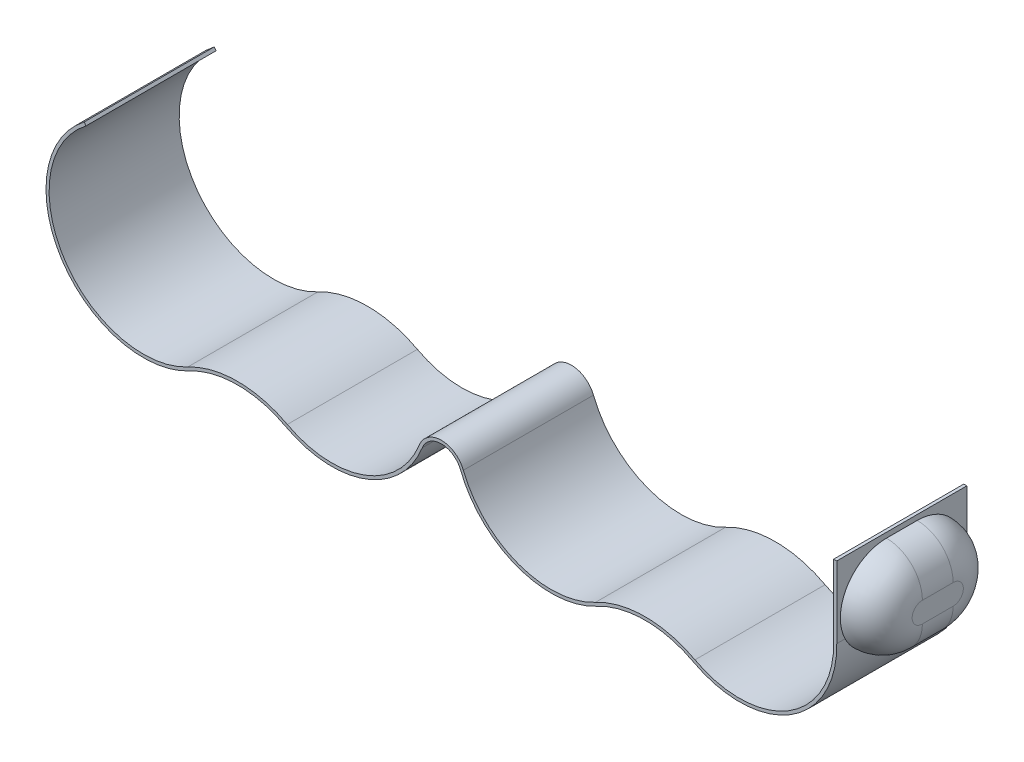
ISO-10303-21;
HEADER;
FILE_DESCRIPTION(('STEP AP214'),'2;1');
FILE_NAME('part.step','',(''),(''),'','','');
FILE_SCHEMA(('AUTOMOTIVE_DESIGN { 1 0 10303 214 1 1 1 1 }'));
ENDSEC;
DATA;
#1=APPLICATION_CONTEXT('core data for automotive mechanical design processes');
#2=APPLICATION_PROTOCOL_DEFINITION('international standard','automotive_design',2000,#1);
#3=PRODUCT_CONTEXT('',#1,'mechanical');
#4=PRODUCT('Part','Part','',(#3));
#5=PRODUCT_RELATED_PRODUCT_CATEGORY('part','',(#4));
#6=PRODUCT_DEFINITION_FORMATION('','',#4);
#7=PRODUCT_DEFINITION_CONTEXT('part definition',#1,'design');
#8=PRODUCT_DEFINITION('design','',#6,#7);
#9=PRODUCT_DEFINITION_SHAPE('','',#8);
#10=(LENGTH_UNIT() NAMED_UNIT(*) SI_UNIT(.MILLI.,.METRE.));
#11=(NAMED_UNIT(*) PLANE_ANGLE_UNIT() SI_UNIT($,.RADIAN.));
#12=(NAMED_UNIT(*) SI_UNIT($,.STERADIAN.) SOLID_ANGLE_UNIT());
#13=UNCERTAINTY_MEASURE_WITH_UNIT(LENGTH_MEASURE(1.E-05),#10,'distance_accuracy_value','');
#14=(GEOMETRIC_REPRESENTATION_CONTEXT(3) GLOBAL_UNCERTAINTY_ASSIGNED_CONTEXT((#13)) GLOBAL_UNIT_ASSIGNED_CONTEXT((#10,
#11,#12)) REPRESENTATION_CONTEXT('',''));
#15=CARTESIAN_POINT('',(0.,0.,0.));
#16=DIRECTION('',(0.,0.,1.));
#17=DIRECTION('',(1.,0.,0.));
#18=AXIS2_PLACEMENT_3D('',#15,#16,#17);
#19=CARTESIAN_POINT('',(29.1,11.5,6.35));
#20=DIRECTION('',(0.,0.,-1.));
#21=DIRECTION('',(-1.,0.,0.));
#22=AXIS2_PLACEMENT_3D('',#19,#20,#21);
#23=CYLINDRICAL_SURFACE('',#22,9.49999999999999);
#24=CARTESIAN_POINT('',(38.5983950642177,11.674617307404,5.53386000206993));
#25=CARTESIAN_POINT('',(38.5986630631285,11.6600390391527,5.52665198756606));
#26=CARTESIAN_POINT('',(38.5988966374525,11.645499346526,5.51936468503523));
#27=CARTESIAN_POINT('',(38.5992974076988,11.6164093473269,5.50458689957417));
#28=CARTESIAN_POINT('',(38.5994641838743,11.6018595319501,5.49709543831724));
#29=CARTESIAN_POINT('',(38.5997313609646,11.5727525289645,5.48190727155781));
#30=CARTESIAN_POINT('',(38.5998313461403,11.5581958493997,5.47420958512914));
#31=CARTESIAN_POINT('',(38.5999649353353,11.5290784160446,5.45860694465073));
#32=CARTESIAN_POINT('',(38.5999981275434,11.5145181872133,5.45070100740795));
#33=CARTESIAN_POINT('',(38.5999981275301,11.4853970198671,5.43467987599623));
#34=CARTESIAN_POINT('',(38.5999645274169,11.4708366233534,5.4265636966541));
#35=CARTESIAN_POINT('',(38.5998309382488,11.4417185484636,5.4101201301041));
#36=CARTESIAN_POINT('',(38.5997305451884,11.4271614292349,5.4017917560499));
#37=CARTESIAN_POINT('',(38.5994633680931,11.39805340353,5.38492188651101));
#38=CARTESIAN_POINT('',(38.5992961839278,11.3835030734703,5.37637940280155));
#39=CARTESIAN_POINT('',(38.5988954139974,11.3544121772569,5.35907944735473));
#40=CARTESIAN_POINT('',(38.5986614318976,11.3398722048464,5.35032098636093));
#41=CARTESIAN_POINT('',(38.5983950642177,11.3253826925965,5.34148080320608));
#42=B_SPLINE_CURVE_WITH_KNOTS('',3,(#24,#25,#26,#27,#28,#29,#30,#31,#32,#33,#34,#35,#36,#37,#38,
#39,#40,#41),.UNSPECIFIED.,.F.,.F.,(4,2,2,2,2,2,2,2,4),(0.,0.0487949925973613,
0.0978919661736322,0.147291764006221,0.196995213957855,0.247003128809342,0.297316306584729,
0.347935530869065,0.398861571118844),.UNSPECIFIED.);
#43=CARTESIAN_POINT('',(38.5983950642177,11.674617307404,5.53386000206993));
#44=VERTEX_POINT('',#43);
#45=CARTESIAN_POINT('',(38.5983950642177,11.3253826925965,5.34148080320608));
#46=VERTEX_POINT('',#45);
#47=EDGE_CURVE('E507',#44,#46,#42,.T.);
#48=ORIENTED_EDGE('',*,*,#47,.F.);
#49=DIRECTION('',(0.,0.,-1.));
#50=VECTOR('',#49,1.);
#51=CARTESIAN_POINT('',(38.5983950642177,11.674617307404,6.35));
#52=LINE('',#51,#50);
#53=CARTESIAN_POINT('',(38.5983950642177,11.674617307404,6.35));
#54=VERTEX_POINT('',#53);
#55=EDGE_CURVE('E226',#54,#44,#52,.T.);
#56=ORIENTED_EDGE('',*,*,#55,.F.);
#57=CARTESIAN_POINT('',(29.1,11.5,6.35));
#58=DIRECTION('',(0.,0.,1.));
#59=DIRECTION('',(1.,0.,0.));
#60=AXIS2_PLACEMENT_3D('',#57,#58,#59);
#61=CIRCLE('',#60,9.49999999999999);
#62=CARTESIAN_POINT('',(24.6179487179487,3.1237707585655,6.35));
#63=VERTEX_POINT('',#62);
#64=EDGE_CURVE('E477',#63,#54,#61,.T.);
#65=ORIENTED_EDGE('',*,*,#64,.F.);
#66=DIRECTION('',(0.,0.,-1.));
#67=VECTOR('',#66,1.);
#68=CARTESIAN_POINT('',(24.6179487179487,3.1237707585655,6.35));
#69=LINE('',#68,#67);
#70=CARTESIAN_POINT('',(24.6179487179487,3.1237707585655,-6.35));
#71=VERTEX_POINT('',#70);
#72=EDGE_CURVE('E355',#63,#71,#69,.T.);
#73=ORIENTED_EDGE('',*,*,#72,.T.);
#74=CARTESIAN_POINT('',(29.1,11.5,-6.35));
#75=DIRECTION('',(0.,0.,1.));
#76=DIRECTION('',(1.,0.,0.));
#77=AXIS2_PLACEMENT_3D('',#74,#75,#76);
#78=CIRCLE('',#77,9.49999999999999);
#79=CARTESIAN_POINT('',(38.5983950642177,11.674617307404,-6.35));
#80=VERTEX_POINT('',#79);
#81=EDGE_CURVE('E395',#71,#80,#78,.T.);
#82=ORIENTED_EDGE('',*,*,#81,.T.);
#83=CARTESIAN_POINT('',(38.5983950642177,11.674617307404,-5.53386000206993));
#84=VERTEX_POINT('',#83);
#85=EDGE_CURVE('E348',#84,#80,#52,.T.);
#86=ORIENTED_EDGE('',*,*,#85,.F.);
#87=CARTESIAN_POINT('',(38.5983950642177,11.3253826925965,-5.34148080320608));
#88=CARTESIAN_POINT('',(38.5986614318976,11.3398722048464,-5.35032098636093));
#89=CARTESIAN_POINT('',(38.5988954139974,11.3544121772569,-5.35907944735473));
#90=CARTESIAN_POINT('',(38.5992961839278,11.3835030734703,-5.37637940280156));
#91=CARTESIAN_POINT('',(38.5994633680931,11.39805340353,-5.38492188651101));
#92=CARTESIAN_POINT('',(38.5997305451884,11.4271614292349,-5.4017917560499));
#93=CARTESIAN_POINT('',(38.5998309382488,11.4417185484636,-5.4101201301041));
#94=CARTESIAN_POINT('',(38.5999645274169,11.4708366233534,-5.4265636966541));
#95=CARTESIAN_POINT('',(38.5999981275301,11.4853970198671,-5.43467987599623));
#96=CARTESIAN_POINT('',(38.5999981275434,11.5145181872133,-5.45070100740795));
#97=CARTESIAN_POINT('',(38.5999649353353,11.5290784160446,-5.45860694465073));
#98=CARTESIAN_POINT('',(38.5998313461403,11.5581958493997,-5.47420958512914));
#99=CARTESIAN_POINT('',(38.5997313609646,11.5727525289645,-5.48190727155781));
#100=CARTESIAN_POINT('',(38.5994641838743,11.6018595319501,-5.49709543831724));
#101=CARTESIAN_POINT('',(38.5992974076988,11.6164093473269,-5.50458689957417));
#102=CARTESIAN_POINT('',(38.5988966374525,11.645499346526,-5.51936468503523));
#103=CARTESIAN_POINT('',(38.5986630631285,11.6600390391527,-5.52665198756606));
#104=CARTESIAN_POINT('',(38.5983950642177,11.674617307404,-5.53386000206993));
#105=B_SPLINE_CURVE_WITH_KNOTS('',3,(#87,#88,#89,#90,#91,#92,#93,#94,#95,#96,#97,#98,#99,#100,
#101,#102,#103,#104),.UNSPECIFIED.,.F.,.F.,(4,2,2,2,2,2,2,2,4),(0.,0.0509260402497801,
0.101545264534112,0.151858442309499,0.201866357160987,0.251569807112623,0.300969604945211,
0.35006657852148,0.398861571118842),.UNSPECIFIED.);
#106=CARTESIAN_POINT('',(38.5983950642177,11.3253826925965,-5.34148080320608));
#107=VERTEX_POINT('',#106);
#108=EDGE_CURVE('E240',#107,#84,#105,.T.);
#109=ORIENTED_EDGE('',*,*,#108,.F.);
#110=CARTESIAN_POINT('',(38.3096101726777,9.16910307664385,-1.5));
#111=CARTESIAN_POINT('',(38.3095868955282,9.16908842534849,-1.62512755664431));
#112=CARTESIAN_POINT('',(38.310930513268,9.17432172401688,-1.75024552474231));
#113=CARTESIAN_POINT('',(38.3161798622304,9.19517039493367,-1.9995334997406));
#114=CARTESIAN_POINT('',(38.3200850479459,9.21078355671407,-2.12370370278096));
#115=CARTESIAN_POINT('',(38.3302726262404,9.25222384662015,-2.36989839799261));
#116=CARTESIAN_POINT('',(38.3365487623277,9.27802410095488,-2.49192766044714));
#117=CARTESIAN_POINT('',(38.351145680719,9.33960733970354,-2.73328619049127));
#118=CARTESIAN_POINT('',(38.3594665200447,9.37539060252255,-2.85261538268123));
#119=CARTESIAN_POINT('',(38.3868919656161,9.49733144078351,-3.20531373574449));
#120=CARTESIAN_POINT('',(38.4084694589623,9.59811608011106,-3.43360571443809));
#121=CARTESIAN_POINT('',(38.4538922646843,9.83589810961581,-3.87031684900781));
#122=CARTESIAN_POINT('',(38.4777385008848,9.97291029228169,-4.07872783963604));
#123=CARTESIAN_POINT('',(38.512211319716,10.2087787539587,-4.37996105425983));
#124=CARTESIAN_POINT('',(38.5238699439507,10.2961633755042,-4.48182696067868));
#125=CARTESIAN_POINT('',(38.5455139616557,10.4797972751876,-4.67746958713357));
#126=CARTESIAN_POINT('',(38.5554993679915,10.5760464851565,-4.77124636936454));
#127=CARTESIAN_POINT('',(38.5729777341404,10.7769093258389,-4.95012093193739));
#128=CARTESIAN_POINT('',(38.5804648887445,10.8815417472175,-5.03519818357597));
#129=CARTESIAN_POINT('',(38.5921205581904,11.0981634340156,-5.19574002427003));
#130=CARTESIAN_POINT('',(38.5962879028057,11.2101552785725,-5.27120121581649));
#131=CARTESIAN_POINT('',(38.5983950642177,11.3253826925965,-5.34148080320608));
#132=B_SPLINE_CURVE_WITH_KNOTS('',3,(#110,#111,#112,#113,#114,#115,#116,#117,#118,#119,#120,
#121,#122,#123,#124,#125,#126,#127,#128,#129,#130,#131),.UNSPECIFIED.,.F.,.F.,(4,2,2,2,2,2,2,2,
2,2,4),(0.,0.375249781385472,0.750419676163439,1.12460640630209,1.49880357276409,
2.24656015914001,2.99462254345786,3.39830747917489,3.80198931079888,4.20660275284733,
4.61135875730409),.UNSPECIFIED.);
#133=CARTESIAN_POINT('',(38.3096101726777,9.16910307664385,-1.5));
#134=VERTEX_POINT('',#133);
#135=EDGE_CURVE('E227',#134,#107,#132,.T.);
#136=ORIENTED_EDGE('',*,*,#135,.F.);
#137=DIRECTION('',(0.,0.,-1.));
#138=VECTOR('',#137,1.);
#139=CARTESIAN_POINT('',(38.3096101726777,9.16910307664385,6.35));
#140=LINE('',#139,#138);
#141=CARTESIAN_POINT('',(38.3096101726777,9.16910307664385,1.5));
#142=VERTEX_POINT('',#141);
#143=EDGE_CURVE('E282',#142,#134,#140,.T.);
#144=ORIENTED_EDGE('',*,*,#143,.F.);
#145=CARTESIAN_POINT('',(38.5983950642177,11.3253826925965,5.34148080320608));
#146=CARTESIAN_POINT('',(38.5964309511884,11.2180735956539,5.27602694331638));
#147=CARTESIAN_POINT('',(38.592682059442,11.1135661926352,5.20608091977004));
#148=CARTESIAN_POINT('',(38.5822569053851,10.910887128789,5.05780446389393));
#149=CARTESIAN_POINT('',(38.5755816774317,10.8127132433384,4.97947700149644));
#150=CARTESIAN_POINT('',(38.5599579434277,10.62352870435,4.81513987880919));
#151=CARTESIAN_POINT('',(38.5510135872179,10.5325053674681,4.72914442615644));
#152=CARTESIAN_POINT('',(38.5315220130518,10.3580280395505,4.54998896622055));
#153=CARTESIAN_POINT('',(38.5209746774402,10.2745746048481,4.45682843328379));
#154=CARTESIAN_POINT('',(38.4879568307323,10.0364674683081,4.16762070450599));
#155=CARTESIAN_POINT('',(38.4640869451993,9.8938211693606,3.96163326294085));
#156=CARTESIAN_POINT('',(38.4179219829146,9.64459791969355,3.5287254925697));
#157=CARTESIAN_POINT('',(38.3956268634966,9.53801999145048,3.30180573128272));
#158=CARTESIAN_POINT('',(38.3661554142768,9.40463265143685,2.9429225506491));
#159=CARTESIAN_POINT('',(38.356784971456,9.36382884008897,2.81618598427103));
#160=CARTESIAN_POINT('',(38.340290074126,9.29356655248538,2.55942436590148));
#161=CARTESIAN_POINT('',(38.3331656834918,9.26410839888075,2.42939922050048));
#162=CARTESIAN_POINT('',(38.3215757249923,9.21676339404465,2.16672989598527));
#163=CARTESIAN_POINT('',(38.3171184590243,9.19891265816033,2.0340788533914));
#164=CARTESIAN_POINT('',(38.3111201472742,9.17507158134166,1.7676227747195));
#165=CARTESIAN_POINT('',(38.3095797215452,9.16908376217795,1.63381749934955));
#166=CARTESIAN_POINT('',(38.3096101726777,9.16910307664385,1.5));
#167=B_SPLINE_CURVE_WITH_KNOTS('',3,(#145,#146,#147,#148,#149,#150,#151,#152,#153,#154,#155,
#156,#157,#158,#159,#160,#161,#162,#163,#164,#165,#166),.UNSPECIFIED.,.F.,.F.,(4,2,2,2,2,2,2,2,
2,2,4),(0.,0.376973483290361,0.753813826996727,1.12996990181774,1.50615359904433,
2.25755281984319,3.00893167462031,3.40888577775613,3.80885125406211,4.21005530361564,
4.61134463034871),.UNSPECIFIED.);
#168=EDGE_CURVE('E279',#46,#142,#167,.T.);
#169=ORIENTED_EDGE('',*,*,#168,.F.);
#170=EDGE_LOOP('',(#48,#56,#65,#73,#82,#86,#109,#136,#144,#169));
#171=FACE_BOUND('',#170,.T.);
#172=ADVANCED_FACE('F32',(#171),#23,.T.);
#173=CARTESIAN_POINT('',(38.5983950642177,11.674617307404,6.35));
#174=DIRECTION('',(-1.,0.,0.));
#175=DIRECTION('',(0.,0.,1.));
#176=AXIS2_PLACEMENT_3D('',#173,#174,#175);
#177=PLANE('',#176);
#178=CARTESIAN_POINT('',(38.5983950642177,13.6691030766439,1.5));
#179=DIRECTION('',(1.,0.,0.));
#180=DIRECTION('',(0.,0.,-1.));
#181=AXIS2_PLACEMENT_3D('',#178,#179,#180);
#182=CIRCLE('',#181,4.5);
#183=CARTESIAN_POINT('',(38.5983950642177,18.1691030766439,1.5));
#184=VERTEX_POINT('',#183);
#185=EDGE_CURVE('E210',#184,#44,#182,.T.);
#186=ORIENTED_EDGE('',*,*,#185,.F.);
#187=DIRECTION('',(0.,0.,1.));
#188=VECTOR('',#187,1.);
#189=CARTESIAN_POINT('',(38.5983950642177,18.1691030766439,1.5));
#190=LINE('',#189,#188);
#191=CARTESIAN_POINT('',(38.5983950642177,18.1691030766439,-1.5));
#192=VERTEX_POINT('',#191);
#193=EDGE_CURVE('E217',#192,#184,#190,.T.);
#194=ORIENTED_EDGE('',*,*,#193,.F.);
#195=CARTESIAN_POINT('',(38.5983950642177,13.6691030766439,-1.5));
#196=DIRECTION('',(-1.,0.,0.));
#197=DIRECTION('',(0.,0.,1.));
#198=AXIS2_PLACEMENT_3D('',#195,#196,#197);
#199=CIRCLE('',#198,4.5);
#200=EDGE_CURVE('E337',#84,#192,#199,.F.);
#201=ORIENTED_EDGE('',*,*,#200,.F.);
#202=ORIENTED_EDGE('',*,*,#85,.T.);
#203=DIRECTION('',(0.,1.,0.));
#204=VECTOR('',#203,1.);
#205=CARTESIAN_POINT('',(38.5983950642177,11.674617307404,-6.35));
#206=LINE('',#205,#204);
#207=CARTESIAN_POINT('',(38.5983950642177,18.6691030766439,-6.35));
#208=VERTEX_POINT('',#207);
#209=EDGE_CURVE('E401',#80,#208,#206,.T.);
#210=ORIENTED_EDGE('',*,*,#209,.T.);
#211=DIRECTION('',(0.,0.,-1.));
#212=VECTOR('',#211,1.);
#213=CARTESIAN_POINT('',(38.5983950642177,18.6691030766439,6.35));
#214=LINE('',#213,#212);
#215=CARTESIAN_POINT('',(38.5983950642177,18.6691030766439,6.35));
#216=VERTEX_POINT('',#215);
#217=EDGE_CURVE('E350',#216,#208,#214,.T.);
#218=ORIENTED_EDGE('',*,*,#217,.F.);
#219=DIRECTION('',(0.,1.,0.));
#220=VECTOR('',#219,1.);
#221=CARTESIAN_POINT('',(38.5983950642177,11.674617307404,6.35));
#222=LINE('',#221,#220);
#223=EDGE_CURVE('E475',#54,#216,#222,.T.);
#224=ORIENTED_EDGE('',*,*,#223,.F.);
#225=ORIENTED_EDGE('',*,*,#55,.T.);
#226=EDGE_LOOP('',(#186,#194,#201,#202,#210,#218,#224,#225));
#227=FACE_BOUND('',#226,.T.);
#228=ADVANCED_FACE('F222',(#227),#177,.F.);
#229=CARTESIAN_POINT('',(-19.9,-5.69331265347081,6.35));
#230=DIRECTION('',(0.,0.,-1.));
#231=DIRECTION('',(-1.,0.,0.));
#232=AXIS2_PLACEMENT_3D('',#229,#230,#231);
#233=CYLINDRICAL_SURFACE('',#232,10.);
#234=CARTESIAN_POINT('',(-19.9,-5.69331265347081,-6.35));
#235=DIRECTION('',(0.,0.,-1.));
#236=DIRECTION('',(1.,0.,0.));
#237=AXIS2_PLACEMENT_3D('',#234,#235,#236);
#238=CIRCLE('',#237,10.);
#239=CARTESIAN_POINT('',(-24.6179487179487,3.1237707585655,-6.35));
#240=VERTEX_POINT('',#239);
#241=CARTESIAN_POINT('',(-15.1820512820513,3.1237707585655,-6.35));
#242=VERTEX_POINT('',#241);
#243=EDGE_CURVE('E503',#240,#242,#238,.T.);
#244=ORIENTED_EDGE('',*,*,#243,.T.);
#245=DIRECTION('',(0.,0.,-1.));
#246=VECTOR('',#245,1.);
#247=CARTESIAN_POINT('',(-15.1820512820513,3.1237707585655,6.35));
#248=LINE('',#247,#246);
#249=CARTESIAN_POINT('',(-15.1820512820513,3.1237707585655,6.35));
#250=VERTEX_POINT('',#249);
#251=EDGE_CURVE('E345',#250,#242,#248,.T.);
#252=ORIENTED_EDGE('',*,*,#251,.F.);
#253=CARTESIAN_POINT('',(-19.9,-5.69331265347081,6.35));
#254=DIRECTION('',(0.,0.,-1.));
#255=DIRECTION('',(1.,0.,0.));
#256=AXIS2_PLACEMENT_3D('',#253,#254,#255);
#257=CIRCLE('',#256,10.);
#258=CARTESIAN_POINT('',(-24.6179487179487,3.1237707585655,6.35));
#259=VERTEX_POINT('',#258);
#260=EDGE_CURVE('E291',#259,#250,#257,.T.);
#261=ORIENTED_EDGE('',*,*,#260,.F.);
#262=DIRECTION('',(0.,0.,-1.));
#263=VECTOR('',#262,1.);
#264=CARTESIAN_POINT('',(-24.6179487179487,3.1237707585655,6.35));
#265=LINE('',#264,#263);
#266=EDGE_CURVE('E436',#259,#240,#265,.T.);
#267=ORIENTED_EDGE('',*,*,#266,.T.);
#268=EDGE_LOOP('',(#244,#252,#261,#267));
#269=FACE_BOUND('',#268,.T.);
#270=ADVANCED_FACE('F318',(#269),#233,.F.);
#271=CARTESIAN_POINT('',(-10.7,11.5,6.35));
#272=DIRECTION('',(0.,0.,-1.));
#273=DIRECTION('',(-1.,0.,0.));
#274=AXIS2_PLACEMENT_3D('',#271,#272,#273);
#275=CYLINDRICAL_SURFACE('',#274,9.5);
#276=CARTESIAN_POINT('',(-10.7,11.5,-6.35));
#277=DIRECTION('',(0.,0.,1.));
#278=DIRECTION('',(1.,0.,0.));
#279=AXIS2_PLACEMENT_3D('',#276,#277,#278);
#280=CIRCLE('',#279,9.5);
#281=CARTESIAN_POINT('',(-1.86823913367211,8.,-6.35));
#282=VERTEX_POINT('',#281);
#283=EDGE_CURVE('E506',#242,#282,#280,.T.);
#284=ORIENTED_EDGE('',*,*,#283,.T.);
#285=DIRECTION('',(0.,0.,-1.));
#286=VECTOR('',#285,1.);
#287=CARTESIAN_POINT('',(-1.86823913367211,8.,6.35));
#288=LINE('',#287,#286);
#289=CARTESIAN_POINT('',(-1.86823913367211,8.,6.35));
#290=VERTEX_POINT('',#289);
#291=EDGE_CURVE('E528',#290,#282,#288,.T.);
#292=ORIENTED_EDGE('',*,*,#291,.F.);
#293=CARTESIAN_POINT('',(-10.7,11.5,6.35));
#294=DIRECTION('',(0.,0.,1.));
#295=DIRECTION('',(1.,0.,0.));
#296=AXIS2_PLACEMENT_3D('',#293,#294,#295);
#297=CIRCLE('',#296,9.5);
#298=EDGE_CURVE('E537',#250,#290,#297,.T.);
#299=ORIENTED_EDGE('',*,*,#298,.F.);
#300=ORIENTED_EDGE('',*,*,#251,.T.);
#301=EDGE_LOOP('',(#284,#292,#299,#300));
#302=FACE_BOUND('',#301,.T.);
#303=ADVANCED_FACE('F535',(#302),#275,.T.);
#304=CARTESIAN_POINT('',(0.,7.2596225071285,6.35));
#305=DIRECTION('',(0.,0.,-1.));
#306=DIRECTION('',(-1.,0.,0.));
#307=AXIS2_PLACEMENT_3D('',#304,#305,#306);
#308=CYLINDRICAL_SURFACE('',#307,2.00959605207981);
#309=CARTESIAN_POINT('',(0.,7.2596225071285,-6.35));
#310=DIRECTION('',(0.,0.,-1.));
#311=DIRECTION('',(-1.,0.,0.));
#312=AXIS2_PLACEMENT_3D('',#309,#310,#311);
#313=CIRCLE('',#312,2.00959605207981);
#314=CARTESIAN_POINT('',(1.86823913367219,8.,-6.35));
#315=VERTEX_POINT('',#314);
#316=EDGE_CURVE('E509',#282,#315,#313,.T.);
#317=ORIENTED_EDGE('',*,*,#316,.T.);
#318=DIRECTION('',(0.,0.,-1.));
#319=VECTOR('',#318,1.);
#320=CARTESIAN_POINT('',(1.86823913367219,8.,6.35));
#321=LINE('',#320,#319);
#322=CARTESIAN_POINT('',(1.86823913367219,8.,6.35));
#323=VERTEX_POINT('',#322);
#324=EDGE_CURVE('E524',#323,#315,#321,.T.);
#325=ORIENTED_EDGE('',*,*,#324,.F.);
#326=CARTESIAN_POINT('',(0.,7.2596225071285,6.35));
#327=DIRECTION('',(0.,0.,-1.));
#328=DIRECTION('',(-1.,0.,0.));
#329=AXIS2_PLACEMENT_3D('',#326,#327,#328);
#330=CIRCLE('',#329,2.00959605207981);
#331=EDGE_CURVE('E799',#290,#323,#330,.T.);
#332=ORIENTED_EDGE('',*,*,#331,.F.);
#333=ORIENTED_EDGE('',*,*,#291,.T.);
#334=EDGE_LOOP('',(#317,#325,#332,#333));
#335=FACE_BOUND('',#334,.T.);
#336=ADVANCED_FACE('F677',(#335),#308,.F.);
#337=CARTESIAN_POINT('',(10.7,11.5,6.35));
#338=DIRECTION('',(0.,0.,-1.));
#339=DIRECTION('',(-1.,0.,0.));
#340=AXIS2_PLACEMENT_3D('',#337,#338,#339);
#341=CYLINDRICAL_SURFACE('',#340,9.49999999999999);
#342=CARTESIAN_POINT('',(10.7,11.5,-6.35));
#343=DIRECTION('',(0.,0.,1.));
#344=DIRECTION('',(1.,0.,0.));
#345=AXIS2_PLACEMENT_3D('',#342,#343,#344);
#346=CIRCLE('',#345,9.49999999999999);
#347=CARTESIAN_POINT('',(15.1820512820513,3.12377075856549,-6.35));
#348=VERTEX_POINT('',#347);
#349=EDGE_CURVE('E511',#315,#348,#346,.T.);
#350=ORIENTED_EDGE('',*,*,#349,.T.);
#351=DIRECTION('',(0.,0.,-1.));
#352=VECTOR('',#351,1.);
#353=CARTESIAN_POINT('',(15.1820512820513,3.12377075856549,6.35));
#354=LINE('',#353,#352);
#355=CARTESIAN_POINT('',(15.1820512820513,3.12377075856549,6.35));
#356=VERTEX_POINT('',#355);
#357=EDGE_CURVE('E516',#356,#348,#354,.T.);
#358=ORIENTED_EDGE('',*,*,#357,.F.);
#359=CARTESIAN_POINT('',(10.7,11.5,6.35));
#360=DIRECTION('',(0.,0.,1.));
#361=DIRECTION('',(1.,0.,0.));
#362=AXIS2_PLACEMENT_3D('',#359,#360,#361);
#363=CIRCLE('',#362,9.49999999999999);
#364=EDGE_CURVE('E525',#323,#356,#363,.T.);
#365=ORIENTED_EDGE('',*,*,#364,.F.);
#366=ORIENTED_EDGE('',*,*,#324,.T.);
#367=EDGE_LOOP('',(#350,#358,#365,#366));
#368=FACE_BOUND('',#367,.T.);
#369=ADVANCED_FACE('F521',(#368),#341,.T.);
#370=CARTESIAN_POINT('',(19.9,-5.69331265347081,6.35));
#371=DIRECTION('',(0.,0.,-1.));
#372=DIRECTION('',(-1.,0.,0.));
#373=AXIS2_PLACEMENT_3D('',#370,#371,#372);
#374=CYLINDRICAL_SURFACE('',#373,9.99999999999998);
#375=CARTESIAN_POINT('',(19.9,-5.69331265347081,-6.35));
#376=DIRECTION('',(0.,0.,-1.));
#377=DIRECTION('',(1.,0.,0.));
#378=AXIS2_PLACEMENT_3D('',#375,#376,#377);
#379=CIRCLE('',#378,9.99999999999998);
#380=EDGE_CURVE('E402',#348,#71,#379,.T.);
#381=ORIENTED_EDGE('',*,*,#380,.T.);
#382=ORIENTED_EDGE('',*,*,#72,.F.);
#383=CARTESIAN_POINT('',(19.9,-5.69331265347081,6.35));
#384=DIRECTION('',(0.,0.,-1.));
#385=DIRECTION('',(1.,0.,0.));
#386=AXIS2_PLACEMENT_3D('',#383,#384,#385);
#387=CIRCLE('',#386,9.99999999999998);
#388=EDGE_CURVE('E481',#356,#63,#387,.T.);
#389=ORIENTED_EDGE('',*,*,#388,.F.);
#390=ORIENTED_EDGE('',*,*,#357,.T.);
#391=EDGE_LOOP('',(#381,#382,#389,#390));
#392=FACE_BOUND('',#391,.T.);
#393=ADVANCED_FACE('F323',(#392),#374,.F.);
#394=CARTESIAN_POINT('',(38.5983950642177,18.6691030766439,6.35));
#395=DIRECTION('',(0.,-1.,0.));
#396=DIRECTION('',(0.,0.,-1.));
#397=AXIS2_PLACEMENT_3D('',#394,#395,#396);
#398=PLANE('',#397);
#399=DIRECTION('',(-1.,0.,0.));
#400=VECTOR('',#399,1.);
#401=CARTESIAN_POINT('',(38.5983950642177,18.6691030766439,-6.35));
#402=LINE('',#401,#400);
#403=CARTESIAN_POINT('',(38.2984457464003,18.6691030766439,-6.35));
#404=VERTEX_POINT('',#403);
#405=EDGE_CURVE('E407',#208,#404,#402,.T.);
#406=ORIENTED_EDGE('',*,*,#405,.T.);
#407=DIRECTION('',(0.,0.,-1.));
#408=VECTOR('',#407,1.);
#409=CARTESIAN_POINT('',(38.2984457464003,18.6691030766439,6.35));
#410=LINE('',#409,#408);
#411=CARTESIAN_POINT('',(38.2984457464003,18.6691030766439,6.35));
#412=VERTEX_POINT('',#411);
#413=EDGE_CURVE('E466',#412,#404,#410,.T.);
#414=ORIENTED_EDGE('',*,*,#413,.F.);
#415=DIRECTION('',(-1.,0.,0.));
#416=VECTOR('',#415,1.);
#417=CARTESIAN_POINT('',(38.5983950642177,18.6691030766439,6.35));
#418=LINE('',#417,#416);
#419=EDGE_CURVE('E474',#216,#412,#418,.T.);
#420=ORIENTED_EDGE('',*,*,#419,.F.);
#421=ORIENTED_EDGE('',*,*,#217,.T.);
#422=EDGE_LOOP('',(#406,#414,#420,#421));
#423=FACE_BOUND('',#422,.T.);
#424=ADVANCED_FACE('F473',(#423),#398,.F.);
#425=CARTESIAN_POINT('',(38.2984457464003,18.6691030766439,6.35));
#426=DIRECTION('',(1.,0.,0.));
#427=DIRECTION('',(0.,0.,-1.));
#428=AXIS2_PLACEMENT_3D('',#425,#426,#427);
#429=PLANE('',#428);
#430=DIRECTION('',(0.,-1.,0.));
#431=VECTOR('',#430,1.);
#432=CARTESIAN_POINT('',(38.2984457464003,18.6691030766439,-6.35));
#433=LINE('',#432,#431);
#434=CARTESIAN_POINT('',(38.2984457464003,11.6691030766439,-6.35));
#435=VERTEX_POINT('',#434);
#436=EDGE_CURVE('E411',#404,#435,#433,.T.);
#437=ORIENTED_EDGE('',*,*,#436,.T.);
#438=DIRECTION('',(0.,0.,-1.));
#439=VECTOR('',#438,1.);
#440=CARTESIAN_POINT('',(38.2984457464003,11.6691030766439,6.35));
#441=LINE('',#440,#439);
#442=CARTESIAN_POINT('',(38.2984457464003,11.6691030766439,6.35));
#443=VERTEX_POINT('',#442);
#444=EDGE_CURVE('E464',#443,#435,#441,.T.);
#445=ORIENTED_EDGE('',*,*,#444,.F.);
#446=DIRECTION('',(0.,-1.,0.));
#447=VECTOR('',#446,1.);
#448=CARTESIAN_POINT('',(38.2984457464003,18.6691030766439,6.35));
#449=LINE('',#448,#447);
#450=EDGE_CURVE('E479',#412,#443,#449,.T.);
#451=ORIENTED_EDGE('',*,*,#450,.F.);
#452=ORIENTED_EDGE('',*,*,#413,.T.);
#453=EDGE_LOOP('',(#437,#445,#451,#452));
#454=FACE_BOUND('',#453,.T.);
#455=ADVANCED_FACE('F585',(#454),#429,.F.);
#456=CARTESIAN_POINT('',(29.1,11.5,6.35));
#457=DIRECTION('',(0.,0.,-1.));
#458=DIRECTION('',(-1.,0.,0.));
#459=AXIS2_PLACEMENT_3D('',#456,#457,#458);
#460=CYLINDRICAL_SURFACE('',#459,9.2);
#461=CARTESIAN_POINT('',(29.1,11.5,-6.35));
#462=DIRECTION('',(0.,0.,-1.));
#463=DIRECTION('',(1.,0.,0.));
#464=AXIS2_PLACEMENT_3D('',#461,#462,#463);
#465=CIRCLE('',#464,9.2);
#466=CARTESIAN_POINT('',(24.7594871794872,3.3882832609266,-6.35));
#467=VERTEX_POINT('',#466);
#468=EDGE_CURVE('E416',#435,#467,#465,.T.);
#469=ORIENTED_EDGE('',*,*,#468,.T.);
#470=DIRECTION('',(0.,0.,-1.));
#471=VECTOR('',#470,1.);
#472=CARTESIAN_POINT('',(24.7594871794872,3.3882832609266,6.35));
#473=LINE('',#472,#471);
#474=CARTESIAN_POINT('',(24.7594871794872,3.3882832609266,6.35));
#475=VERTEX_POINT('',#474);
#476=EDGE_CURVE('E461',#475,#467,#473,.T.);
#477=ORIENTED_EDGE('',*,*,#476,.F.);
#478=CARTESIAN_POINT('',(29.1,11.5,6.35));
#479=DIRECTION('',(0.,0.,-1.));
#480=DIRECTION('',(1.,0.,0.));
#481=AXIS2_PLACEMENT_3D('',#478,#479,#480);
#482=CIRCLE('',#481,9.2);
#483=EDGE_CURVE('E486',#443,#475,#482,.T.);
#484=ORIENTED_EDGE('',*,*,#483,.F.);
#485=ORIENTED_EDGE('',*,*,#444,.T.);
#486=EDGE_LOOP('',(#469,#477,#484,#485));
#487=FACE_BOUND('',#486,.T.);
#488=ADVANCED_FACE('F582',(#487),#460,.F.);
#489=CARTESIAN_POINT('',(19.9,-5.69331265347081,6.35));
#490=DIRECTION('',(0.,0.,-1.));
#491=DIRECTION('',(-1.,0.,0.));
#492=AXIS2_PLACEMENT_3D('',#489,#490,#491);
#493=CYLINDRICAL_SURFACE('',#492,10.3);
#494=CARTESIAN_POINT('',(19.9,-5.69331265347081,-6.35));
#495=DIRECTION('',(0.,0.,1.));
#496=DIRECTION('',(1.,0.,0.));
#497=AXIS2_PLACEMENT_3D('',#494,#495,#496);
#498=CIRCLE('',#497,10.3);
#499=CARTESIAN_POINT('',(15.0405128205128,3.38828326092659,-6.35));
#500=VERTEX_POINT('',#499);
#501=EDGE_CURVE('E418',#467,#500,#498,.T.);
#502=ORIENTED_EDGE('',*,*,#501,.T.);
#503=DIRECTION('',(0.,0.,-1.));
#504=VECTOR('',#503,1.);
#505=CARTESIAN_POINT('',(15.0405128205128,3.38828326092659,6.35));
#506=LINE('',#505,#504);
#507=CARTESIAN_POINT('',(15.0405128205128,3.38828326092659,6.35));
#508=VERTEX_POINT('',#507);
#509=EDGE_CURVE('E458',#508,#500,#506,.T.);
#510=ORIENTED_EDGE('',*,*,#509,.F.);
#511=CARTESIAN_POINT('',(19.9,-5.69331265347081,6.35));
#512=DIRECTION('',(0.,0.,1.));
#513=DIRECTION('',(1.,0.,0.));
#514=AXIS2_PLACEMENT_3D('',#511,#512,#513);
#515=CIRCLE('',#514,10.3);
#516=EDGE_CURVE('E488',#475,#508,#515,.T.);
#517=ORIENTED_EDGE('',*,*,#516,.F.);
#518=ORIENTED_EDGE('',*,*,#476,.T.);
#519=EDGE_LOOP('',(#502,#510,#517,#518));
#520=FACE_BOUND('',#519,.T.);
#521=ADVANCED_FACE('F578',(#520),#493,.T.);
#522=CARTESIAN_POINT('',(10.7,11.5,6.35));
#523=DIRECTION('',(0.,0.,-1.));
#524=DIRECTION('',(-1.,0.,0.));
#525=AXIS2_PLACEMENT_3D('',#522,#523,#524);
#526=CYLINDRICAL_SURFACE('',#525,9.19999999999999);
#527=CARTESIAN_POINT('',(10.7,11.5,-6.35));
#528=DIRECTION('',(0.,0.,-1.));
#529=DIRECTION('',(1.,0.,0.));
#530=AXIS2_PLACEMENT_3D('',#527,#528,#529);
#531=CIRCLE('',#530,9.19999999999999);
#532=CARTESIAN_POINT('',(2.14713684524044,8.11052631578948,-6.35));
#533=VERTEX_POINT('',#532);
#534=EDGE_CURVE('E420',#500,#533,#531,.T.);
#535=ORIENTED_EDGE('',*,*,#534,.T.);
#536=DIRECTION('',(0.,0.,-1.));
#537=VECTOR('',#536,1.);
#538=CARTESIAN_POINT('',(2.14713684524044,8.11052631578948,6.35));
#539=LINE('',#538,#537);
#540=CARTESIAN_POINT('',(2.14713684524044,8.11052631578948,6.35));
#541=VERTEX_POINT('',#540);
#542=EDGE_CURVE('E455',#541,#533,#539,.T.);
#543=ORIENTED_EDGE('',*,*,#542,.F.);
#544=CARTESIAN_POINT('',(10.7,11.5,6.35));
#545=DIRECTION('',(0.,0.,-1.));
#546=DIRECTION('',(1.,0.,0.));
#547=AXIS2_PLACEMENT_3D('',#544,#545,#546);
#548=CIRCLE('',#547,9.19999999999999);
#549=EDGE_CURVE('E490',#508,#541,#548,.T.);
#550=ORIENTED_EDGE('',*,*,#549,.F.);
#551=ORIENTED_EDGE('',*,*,#509,.T.);
#552=EDGE_LOOP('',(#535,#543,#550,#551));
#553=FACE_BOUND('',#552,.T.);
#554=ADVANCED_FACE('F574',(#553),#526,.F.);
#555=CARTESIAN_POINT('',(0.,7.2596225071285,6.35));
#556=DIRECTION('',(0.,0.,-1.));
#557=DIRECTION('',(-1.,0.,0.));
#558=AXIS2_PLACEMENT_3D('',#555,#556,#557);
#559=CYLINDRICAL_SURFACE('',#558,2.30959605207981);
#560=CARTESIAN_POINT('',(0.,7.2596225071285,-6.35));
#561=DIRECTION('',(0.,0.,1.));
#562=DIRECTION('',(-1.,0.,0.));
#563=AXIS2_PLACEMENT_3D('',#560,#561,#562);
#564=CIRCLE('',#563,2.30959605207981);
#565=CARTESIAN_POINT('',(-2.14713684524035,8.11052631578947,-6.35));
#566=VERTEX_POINT('',#565);
#567=EDGE_CURVE('E422',#533,#566,#564,.T.);
#568=ORIENTED_EDGE('',*,*,#567,.T.);
#569=DIRECTION('',(0.,0.,-1.));
#570=VECTOR('',#569,1.);
#571=CARTESIAN_POINT('',(-2.14713684524035,8.11052631578947,6.35));
#572=LINE('',#571,#570);
#573=CARTESIAN_POINT('',(-2.14713684524035,8.11052631578947,6.35));
#574=VERTEX_POINT('',#573);
#575=EDGE_CURVE('E452',#574,#566,#572,.T.);
#576=ORIENTED_EDGE('',*,*,#575,.F.);
#577=CARTESIAN_POINT('',(0.,7.2596225071285,6.35));
#578=DIRECTION('',(0.,0.,1.));
#579=DIRECTION('',(-1.,0.,0.));
#580=AXIS2_PLACEMENT_3D('',#577,#578,#579);
#581=CIRCLE('',#580,2.30959605207981);
#582=EDGE_CURVE('E492',#541,#574,#581,.T.);
#583=ORIENTED_EDGE('',*,*,#582,.F.);
#584=ORIENTED_EDGE('',*,*,#542,.T.);
#585=EDGE_LOOP('',(#568,#576,#583,#584));
#586=FACE_BOUND('',#585,.T.);
#587=ADVANCED_FACE('F569',(#586),#559,.T.);
#588=CARTESIAN_POINT('',(-10.7,11.5,6.35));
#589=DIRECTION('',(0.,0.,-1.));
#590=DIRECTION('',(-1.,0.,0.));
#591=AXIS2_PLACEMENT_3D('',#588,#589,#590);
#592=CYLINDRICAL_SURFACE('',#591,9.2);
#593=CARTESIAN_POINT('',(-10.7,11.5,-6.35));
#594=DIRECTION('',(0.,0.,-1.));
#595=DIRECTION('',(1.,0.,0.));
#596=AXIS2_PLACEMENT_3D('',#593,#594,#595);
#597=CIRCLE('',#596,9.2);
#598=CARTESIAN_POINT('',(-15.0405128205128,3.38828326092659,-6.35));
#599=VERTEX_POINT('',#598);
#600=EDGE_CURVE('E424',#566,#599,#597,.T.);
#601=ORIENTED_EDGE('',*,*,#600,.T.);
#602=DIRECTION('',(0.,0.,-1.));
#603=VECTOR('',#602,1.);
#604=CARTESIAN_POINT('',(-15.0405128205128,3.38828326092659,6.35));
#605=LINE('',#604,#603);
#606=CARTESIAN_POINT('',(-15.0405128205128,3.38828326092659,6.35));
#607=VERTEX_POINT('',#606);
#608=EDGE_CURVE('E449',#607,#599,#605,.T.);
#609=ORIENTED_EDGE('',*,*,#608,.F.);
#610=CARTESIAN_POINT('',(-10.7,11.5,6.35));
#611=DIRECTION('',(0.,0.,-1.));
#612=DIRECTION('',(1.,0.,0.));
#613=AXIS2_PLACEMENT_3D('',#610,#611,#612);
#614=CIRCLE('',#613,9.2);
#615=EDGE_CURVE('E494',#574,#607,#614,.T.);
#616=ORIENTED_EDGE('',*,*,#615,.F.);
#617=ORIENTED_EDGE('',*,*,#575,.T.);
#618=EDGE_LOOP('',(#601,#609,#616,#617));
#619=FACE_BOUND('',#618,.T.);
#620=ADVANCED_FACE('F563',(#619),#592,.F.);
#621=CARTESIAN_POINT('',(-19.9,-5.69331265347081,6.35));
#622=DIRECTION('',(0.,0.,-1.));
#623=DIRECTION('',(-1.,0.,0.));
#624=AXIS2_PLACEMENT_3D('',#621,#622,#623);
#625=CYLINDRICAL_SURFACE('',#624,10.3);
#626=CARTESIAN_POINT('',(-19.9,-5.69331265347081,-6.35));
#627=DIRECTION('',(0.,0.,1.));
#628=DIRECTION('',(1.,0.,0.));
#629=AXIS2_PLACEMENT_3D('',#626,#627,#628);
#630=CIRCLE('',#629,10.3);
#631=CARTESIAN_POINT('',(-24.7594871794872,3.38828326092659,-6.35));
#632=VERTEX_POINT('',#631);
#633=EDGE_CURVE('E426',#599,#632,#630,.T.);
#634=ORIENTED_EDGE('',*,*,#633,.T.);
#635=DIRECTION('',(0.,0.,-1.));
#636=VECTOR('',#635,1.);
#637=CARTESIAN_POINT('',(-24.7594871794872,3.38828326092659,6.35));
#638=LINE('',#637,#636);
#639=CARTESIAN_POINT('',(-24.7594871794872,3.38828326092659,6.35));
#640=VERTEX_POINT('',#639);
#641=EDGE_CURVE('E446',#640,#632,#638,.T.);
#642=ORIENTED_EDGE('',*,*,#641,.F.);
#643=CARTESIAN_POINT('',(-19.9,-5.69331265347081,6.35));
#644=DIRECTION('',(0.,0.,1.));
#645=DIRECTION('',(1.,0.,0.));
#646=AXIS2_PLACEMENT_3D('',#643,#644,#645);
#647=CIRCLE('',#646,10.3);
#648=EDGE_CURVE('E496',#607,#640,#647,.T.);
#649=ORIENTED_EDGE('',*,*,#648,.F.);
#650=ORIENTED_EDGE('',*,*,#608,.T.);
#651=EDGE_LOOP('',(#634,#642,#649,#650));
#652=FACE_BOUND('',#651,.T.);
#653=ADVANCED_FACE('F559',(#652),#625,.T.);
#654=CARTESIAN_POINT('',(-29.1,11.5,6.35));
#655=DIRECTION('',(0.,0.,-1.));
#656=DIRECTION('',(-1.,0.,0.));
#657=AXIS2_PLACEMENT_3D('',#654,#655,#656);
#658=CYLINDRICAL_SURFACE('',#657,9.2);
#659=CARTESIAN_POINT('',(-29.1,11.5,-6.35));
#660=DIRECTION('',(0.,0.,-1.));
#661=DIRECTION('',(-1.,0.,0.));
#662=AXIS2_PLACEMENT_3D('',#659,#660,#661);
#663=CIRCLE('',#662,9.2);
#664=CARTESIAN_POINT('',(-34.6923615241476,18.805168894915,-6.35));
#665=VERTEX_POINT('',#664);
#666=EDGE_CURVE('E429',#632,#665,#663,.T.);
#667=ORIENTED_EDGE('',*,*,#666,.T.);
#668=DIRECTION('',(0.,0.,-1.));
#669=VECTOR('',#668,1.);
#670=CARTESIAN_POINT('',(-34.6923615241476,18.805168894915,6.35));
#671=LINE('',#670,#669);
#672=CARTESIAN_POINT('',(-34.6923615241476,18.805168894915,6.35));
#673=VERTEX_POINT('',#672);
#674=EDGE_CURVE('E443',#673,#665,#671,.T.);
#675=ORIENTED_EDGE('',*,*,#674,.F.);
#676=CARTESIAN_POINT('',(-29.1,11.5,6.35));
#677=DIRECTION('',(0.,0.,-1.));
#678=DIRECTION('',(1.,0.,0.));
#679=AXIS2_PLACEMENT_3D('',#676,#677,#678);
#680=CIRCLE('',#679,9.19999999999999);
#681=EDGE_CURVE('E498',#640,#673,#680,.T.);
#682=ORIENTED_EDGE('',*,*,#681,.F.);
#683=ORIENTED_EDGE('',*,*,#641,.T.);
#684=EDGE_LOOP('',(#667,#675,#682,#683));
#685=FACE_BOUND('',#684,.T.);
#686=ADVANCED_FACE('F555',(#685),#658,.F.);
#687=CARTESIAN_POINT('',(-34.8747211390655,19.043380924097,6.35));
#688=DIRECTION('',(-0.794040097273377,-0.607865383059511,0.));
#689=DIRECTION('',(0.607865383059511,-0.794040097273377,0.));
#690=AXIS2_PLACEMENT_3D('',#687,#688,#689);
#691=PLANE('',#690);
#692=DIRECTION('',(-0.607865383059511,0.794040097273377,0.));
#693=VECTOR('',#692,1.);
#694=CARTESIAN_POINT('',(-34.8747211390655,19.043380924097,-6.35));
#695=LINE('',#694,#693);
#696=CARTESIAN_POINT('',(-34.8747211390655,19.043380924097,-6.35));
#697=VERTEX_POINT('',#696);
#698=EDGE_CURVE('E431',#665,#697,#695,.T.);
#699=ORIENTED_EDGE('',*,*,#698,.T.);
#700=DIRECTION('',(0.,0.,-1.));
#701=VECTOR('',#700,1.);
#702=CARTESIAN_POINT('',(-34.8747211390655,19.043380924097,6.35));
#703=LINE('',#702,#701);
#704=CARTESIAN_POINT('',(-34.8747211390655,19.043380924097,6.35));
#705=VERTEX_POINT('',#704);
#706=EDGE_CURVE('E439',#705,#697,#703,.T.);
#707=ORIENTED_EDGE('',*,*,#706,.F.);
#708=DIRECTION('',(-0.607865383059511,0.794040097273377,0.));
#709=VECTOR('',#708,1.);
#710=CARTESIAN_POINT('',(-34.8747211390655,19.043380924097,6.35));
#711=LINE('',#710,#709);
#712=EDGE_CURVE('E500',#673,#705,#711,.T.);
#713=ORIENTED_EDGE('',*,*,#712,.F.);
#714=ORIENTED_EDGE('',*,*,#674,.T.);
#715=EDGE_LOOP('',(#699,#707,#713,#714));
#716=FACE_BOUND('',#715,.T.);
#717=ADVANCED_FACE('F546',(#716),#691,.F.);
#718=CARTESIAN_POINT('',(-29.1,11.5,6.35));
#719=DIRECTION('',(0.,0.,-1.));
#720=DIRECTION('',(-1.,0.,0.));
#721=AXIS2_PLACEMENT_3D('',#718,#719,#720);
#722=CYLINDRICAL_SURFACE('',#721,9.49999999999999);
#723=CARTESIAN_POINT('',(-29.1,11.5,-6.35));
#724=DIRECTION('',(0.,0.,1.));
#725=DIRECTION('',(1.,0.,0.));
#726=AXIS2_PLACEMENT_3D('',#723,#724,#725);
#727=CIRCLE('',#726,9.49999999999999);
#728=EDGE_CURVE('E434',#697,#240,#727,.T.);
#729=ORIENTED_EDGE('',*,*,#728,.T.);
#730=ORIENTED_EDGE('',*,*,#266,.F.);
#731=CARTESIAN_POINT('',(-29.1,11.5,6.35));
#732=DIRECTION('',(0.,0.,1.));
#733=DIRECTION('',(-1.,0.,0.));
#734=AXIS2_PLACEMENT_3D('',#731,#732,#733);
#735=CIRCLE('',#734,9.49999999999999);
#736=EDGE_CURVE('E440',#705,#259,#735,.T.);
#737=ORIENTED_EDGE('',*,*,#736,.F.);
#738=ORIENTED_EDGE('',*,*,#706,.T.);
#739=EDGE_LOOP('',(#729,#730,#737,#738));
#740=FACE_BOUND('',#739,.T.);
#741=ADVANCED_FACE('F550',(#740),#722,.T.);
#742=CARTESIAN_POINT('',(-19.9,-5.69331265347081,6.35));
#743=DIRECTION('',(0.,0.,1.));
#744=DIRECTION('',(1.,0.,0.));
#745=AXIS2_PLACEMENT_3D('',#742,#743,#744);
#746=PLANE('',#745);
#747=ORIENTED_EDGE('',*,*,#260,.T.);
#748=ORIENTED_EDGE('',*,*,#298,.T.);
#749=ORIENTED_EDGE('',*,*,#331,.T.);
#750=ORIENTED_EDGE('',*,*,#364,.T.);
#751=ORIENTED_EDGE('',*,*,#388,.T.);
#752=ORIENTED_EDGE('',*,*,#64,.T.);
#753=ORIENTED_EDGE('',*,*,#223,.T.);
#754=ORIENTED_EDGE('',*,*,#419,.T.);
#755=ORIENTED_EDGE('',*,*,#450,.T.);
#756=ORIENTED_EDGE('',*,*,#483,.T.);
#757=ORIENTED_EDGE('',*,*,#516,.T.);
#758=ORIENTED_EDGE('',*,*,#549,.T.);
#759=ORIENTED_EDGE('',*,*,#582,.T.);
#760=ORIENTED_EDGE('',*,*,#615,.T.);
#761=ORIENTED_EDGE('',*,*,#648,.T.);
#762=ORIENTED_EDGE('',*,*,#681,.T.);
#763=ORIENTED_EDGE('',*,*,#712,.T.);
#764=ORIENTED_EDGE('',*,*,#736,.T.);
#765=EDGE_LOOP('',(#747,#748,#749,#750,#751,#752,#753,#754,#755,#756,#757,#758,#759,#760,#761,
#762,#763,#764));
#766=FACE_BOUND('',#765,.T.);
#767=ADVANCED_FACE('F267',(#766),#746,.T.);
#768=CARTESIAN_POINT('',(-19.9,-5.69331265347081,-6.35));
#769=DIRECTION('',(0.,0.,1.));
#770=DIRECTION('',(1.,0.,0.));
#771=AXIS2_PLACEMENT_3D('',#768,#769,#770);
#772=PLANE('',#771);
#773=ORIENTED_EDGE('',*,*,#243,.F.);
#774=ORIENTED_EDGE('',*,*,#728,.F.);
#775=ORIENTED_EDGE('',*,*,#698,.F.);
#776=ORIENTED_EDGE('',*,*,#666,.F.);
#777=ORIENTED_EDGE('',*,*,#633,.F.);
#778=ORIENTED_EDGE('',*,*,#600,.F.);
#779=ORIENTED_EDGE('',*,*,#567,.F.);
#780=ORIENTED_EDGE('',*,*,#534,.F.);
#781=ORIENTED_EDGE('',*,*,#501,.F.);
#782=ORIENTED_EDGE('',*,*,#468,.F.);
#783=ORIENTED_EDGE('',*,*,#436,.F.);
#784=ORIENTED_EDGE('',*,*,#405,.F.);
#785=ORIENTED_EDGE('',*,*,#209,.F.);
#786=ORIENTED_EDGE('',*,*,#81,.F.);
#787=ORIENTED_EDGE('',*,*,#380,.F.);
#788=ORIENTED_EDGE('',*,*,#349,.F.);
#789=ORIENTED_EDGE('',*,*,#316,.F.);
#790=ORIENTED_EDGE('',*,*,#283,.F.);
#791=EDGE_LOOP('',(#773,#774,#775,#776,#777,#778,#779,#780,#781,#782,#783,#784,#785,#786,#787,
#788,#789,#790));
#792=FACE_BOUND('',#791,.T.);
#793=ADVANCED_FACE('F266',(#792),#772,.F.);
#794=CARTESIAN_POINT('',(42.1083950642177,13.6691030766439,1.5));
#795=DIRECTION('',(-1.,0.,0.));
#796=DIRECTION('',(0.,0.,1.));
#797=AXIS2_PLACEMENT_3D('',#794,#795,#796);
#798=CYLINDRICAL_SURFACE('',#797,4.5);
#799=DIRECTION('',(-1.,0.,0.));
#800=VECTOR('',#799,1.);
#801=CARTESIAN_POINT('',(42.1083950642177,9.16910307664385,1.5));
#802=LINE('',#801,#800);
#803=CARTESIAN_POINT('',(38.6083950642177,9.16910307664385,1.5));
#804=VERTEX_POINT('',#803);
#805=EDGE_CURVE('E238',#804,#142,#802,.T.);
#806=ORIENTED_EDGE('',*,*,#805,.F.);
#807=CARTESIAN_POINT('',(38.6083950642177,13.6691030766439,1.5));
#808=DIRECTION('',(1.,0.,0.));
#809=DIRECTION('',(0.,0.,-1.));
#810=AXIS2_PLACEMENT_3D('',#807,#808,#809);
#811=CIRCLE('',#810,4.5);
#812=CARTESIAN_POINT('',(38.6083950642177,18.1691030766439,1.5));
#813=VERTEX_POINT('',#812);
#814=EDGE_CURVE('E11',#804,#813,#811,.F.);
#815=ORIENTED_EDGE('',*,*,#814,.T.);
#816=DIRECTION('',(-1.,0.,0.));
#817=VECTOR('',#816,1.);
#818=CARTESIAN_POINT('',(42.1083950642177,18.1691030766439,1.5));
#819=LINE('',#818,#817);
#820=EDGE_CURVE('E206',#813,#184,#819,.T.);
#821=ORIENTED_EDGE('',*,*,#820,.T.);
#822=ORIENTED_EDGE('',*,*,#185,.T.);
#823=ORIENTED_EDGE('',*,*,#47,.T.);
#824=ORIENTED_EDGE('',*,*,#168,.T.);
#825=EDGE_LOOP('',(#806,#815,#821,#822,#823,#824));
#826=FACE_BOUND('',#825,.T.);
#827=ADVANCED_FACE('F208',(#826),#798,.T.);
#828=CARTESIAN_POINT('',(42.1083950642177,13.6691030766439,-1.5));
#829=DIRECTION('',(-1.,0.,0.));
#830=DIRECTION('',(0.,0.,1.));
#831=AXIS2_PLACEMENT_3D('',#828,#829,#830);
#832=CYLINDRICAL_SURFACE('',#831,4.5);
#833=DIRECTION('',(-1.,0.,0.));
#834=VECTOR('',#833,1.);
#835=CARTESIAN_POINT('',(42.1083950642177,18.1691030766439,-1.5));
#836=LINE('',#835,#834);
#837=CARTESIAN_POINT('',(38.6083950642177,18.1691030766439,-1.5));
#838=VERTEX_POINT('',#837);
#839=EDGE_CURVE('E216',#838,#192,#836,.T.);
#840=ORIENTED_EDGE('',*,*,#839,.F.);
#841=CARTESIAN_POINT('',(38.6083950642177,13.6691030766439,-1.5));
#842=DIRECTION('',(1.,0.,0.));
#843=DIRECTION('',(0.,0.,-1.));
#844=AXIS2_PLACEMENT_3D('',#841,#842,#843);
#845=CIRCLE('',#844,4.5);
#846=CARTESIAN_POINT('',(38.6083950642177,9.16910307664385,-1.5));
#847=VERTEX_POINT('',#846);
#848=EDGE_CURVE('E56',#838,#847,#845,.F.);
#849=ORIENTED_EDGE('',*,*,#848,.T.);
#850=DIRECTION('',(-1.,0.,0.));
#851=VECTOR('',#850,1.);
#852=CARTESIAN_POINT('',(42.1083950642177,9.16910307664385,-1.5));
#853=LINE('',#852,#851);
#854=EDGE_CURVE('E236',#847,#134,#853,.T.);
#855=ORIENTED_EDGE('',*,*,#854,.T.);
#856=ORIENTED_EDGE('',*,*,#135,.T.);
#857=ORIENTED_EDGE('',*,*,#108,.T.);
#858=ORIENTED_EDGE('',*,*,#200,.T.);
#859=EDGE_LOOP('',(#840,#849,#855,#856,#857,#858));
#860=FACE_BOUND('',#859,.T.);
#861=ADVANCED_FACE('F249',(#860),#832,.T.);
#862=CARTESIAN_POINT('',(42.1083950642177,9.16910307664385,1.5));
#863=DIRECTION('',(0.,1.,0.));
#864=DIRECTION('',(0.,0.,1.));
#865=AXIS2_PLACEMENT_3D('',#862,#863,#864);
#866=PLANE('',#865);
#867=ORIENTED_EDGE('',*,*,#854,.F.);
#868=DIRECTION('',(0.,0.,-1.));
#869=VECTOR('',#868,1.);
#870=CARTESIAN_POINT('',(38.6083950642177,9.16910307664385,1.5));
#871=LINE('',#870,#869);
#872=EDGE_CURVE('E41',#847,#804,#871,.F.);
#873=ORIENTED_EDGE('',*,*,#872,.T.);
#874=ORIENTED_EDGE('',*,*,#805,.T.);
#875=ORIENTED_EDGE('',*,*,#143,.T.);
#876=EDGE_LOOP('',(#867,#873,#874,#875));
#877=FACE_BOUND('',#876,.T.);
#878=ADVANCED_FACE('F259',(#877),#866,.F.);
#879=CARTESIAN_POINT('',(42.1083950642177,18.1691030766439,1.5));
#880=DIRECTION('',(0.,-1.,0.));
#881=DIRECTION('',(0.,0.,-1.));
#882=AXIS2_PLACEMENT_3D('',#879,#880,#881);
#883=PLANE('',#882);
#884=ORIENTED_EDGE('',*,*,#820,.F.);
#885=DIRECTION('',(0.,0.,1.));
#886=VECTOR('',#885,1.);
#887=CARTESIAN_POINT('',(38.6083950642177,18.1691030766439,-1.5));
#888=LINE('',#887,#886);
#889=EDGE_CURVE('E367',#813,#838,#888,.F.);
#890=ORIENTED_EDGE('',*,*,#889,.T.);
#891=ORIENTED_EDGE('',*,*,#839,.T.);
#892=ORIENTED_EDGE('',*,*,#193,.T.);
#893=EDGE_LOOP('',(#884,#890,#891,#892));
#894=FACE_BOUND('',#893,.T.);
#895=ADVANCED_FACE('F229',(#894),#883,.F.);
#896=CARTESIAN_POINT('',(42.1083950642177,13.6691030766439,1.5));
#897=DIRECTION('',(1.,0.,0.));
#898=DIRECTION('',(0.,0.,-1.));
#899=AXIS2_PLACEMENT_3D('',#896,#897,#898);
#900=PLANE('',#899);
#901=CARTESIAN_POINT('',(42.1083950642177,13.6691030766439,-1.5));
#902=DIRECTION('',(1.,0.,0.));
#903=DIRECTION('',(0.,0.,-1.));
#904=AXIS2_PLACEMENT_3D('',#901,#902,#903);
#905=CIRCLE('',#904,1.);
#906=CARTESIAN_POINT('',(42.1083950642177,12.6691030766438,-1.5));
#907=VERTEX_POINT('',#906);
#908=CARTESIAN_POINT('',(42.1083950642177,14.6691030766439,-1.5));
#909=VERTEX_POINT('',#908);
#910=EDGE_CURVE('E362',#907,#909,#905,.T.);
#911=ORIENTED_EDGE('',*,*,#910,.T.);
#912=DIRECTION('',(0.,0.,1.));
#913=VECTOR('',#912,1.);
#914=CARTESIAN_POINT('',(42.1083950642177,14.6691030766439,1.5));
#915=LINE('',#914,#913);
#916=CARTESIAN_POINT('',(42.1083950642177,14.6691030766439,1.5));
#917=VERTEX_POINT('',#916);
#918=EDGE_CURVE('E364',#909,#917,#915,.T.);
#919=ORIENTED_EDGE('',*,*,#918,.T.);
#920=CARTESIAN_POINT('',(42.1083950642177,13.6691030766439,1.5));
#921=DIRECTION('',(1.,0.,0.));
#922=DIRECTION('',(0.,0.,-1.));
#923=AXIS2_PLACEMENT_3D('',#920,#921,#922);
#924=CIRCLE('',#923,1.);
#925=CARTESIAN_POINT('',(42.1083950642177,12.6691030766438,1.5));
#926=VERTEX_POINT('',#925);
#927=EDGE_CURVE('E344',#917,#926,#924,.T.);
#928=ORIENTED_EDGE('',*,*,#927,.T.);
#929=DIRECTION('',(0.,0.,-1.));
#930=VECTOR('',#929,1.);
#931=CARTESIAN_POINT('',(42.1083950642177,12.6691030766438,-1.5));
#932=LINE('',#931,#930);
#933=EDGE_CURVE('E360',#926,#907,#932,.T.);
#934=ORIENTED_EDGE('',*,*,#933,.T.);
#935=EDGE_LOOP('',(#911,#919,#928,#934));
#936=FACE_BOUND('',#935,.T.);
#937=ADVANCED_FACE('F303',(#936),#900,.T.);
#938=CARTESIAN_POINT('',(38.6083950642177,12.6691030766438,1.5));
#939=DIRECTION('',(0.,0.,1.));
#940=DIRECTION('',(1.,0.,0.));
#941=AXIS2_PLACEMENT_3D('',#938,#939,#940);
#942=CYLINDRICAL_SURFACE('',#941,3.5);
#943=CARTESIAN_POINT('',(38.6083950642177,12.6691030766438,1.5));
#944=DIRECTION('',(0.,0.,1.));
#945=DIRECTION('',(1.,0.,0.));
#946=AXIS2_PLACEMENT_3D('',#943,#944,#945);
#947=CIRCLE('',#946,3.5);
#948=EDGE_CURVE('E374',#804,#926,#947,.T.);
#949=ORIENTED_EDGE('',*,*,#948,.F.);
#950=ORIENTED_EDGE('',*,*,#872,.F.);
#951=CARTESIAN_POINT('',(38.6083950642177,12.6691030766438,-1.5));
#952=DIRECTION('',(0.,0.,-1.));
#953=DIRECTION('',(0.,1.,0.));
#954=AXIS2_PLACEMENT_3D('',#951,#952,#953);
#955=CIRCLE('',#954,3.5);
#956=EDGE_CURVE('E36',#907,#847,#955,.T.);
#957=ORIENTED_EDGE('',*,*,#956,.F.);
#958=ORIENTED_EDGE('',*,*,#933,.F.);
#959=EDGE_LOOP('',(#949,#950,#957,#958));
#960=FACE_BOUND('',#959,.T.);
#961=ADVANCED_FACE('F34',(#960),#942,.T.);
#962=CARTESIAN_POINT('',(38.6083950642177,13.6691030766439,-1.5));
#963=DIRECTION('',(1.,0.,0.));
#964=DIRECTION('',(0.,0.,-1.));
#965=AXIS2_PLACEMENT_3D('',#962,#963,#964);
#966=DEGENERATE_TOROIDAL_SURFACE('',#965,1.,3.5,.T.);
#967=ORIENTED_EDGE('',*,*,#956,.T.);
#968=ORIENTED_EDGE('',*,*,#848,.F.);
#969=CARTESIAN_POINT('',(38.6083950642177,14.6691030766439,-1.5));
#970=DIRECTION('',(0.,0.,1.));
#971=DIRECTION('',(1.,0.,0.));
#972=AXIS2_PLACEMENT_3D('',#969,#970,#971);
#973=CIRCLE('',#972,3.5);
#974=EDGE_CURVE('E373',#909,#838,#973,.T.);
#975=ORIENTED_EDGE('',*,*,#974,.F.);
#976=ORIENTED_EDGE('',*,*,#910,.F.);
#977=EDGE_LOOP('',(#967,#968,#975,#976));
#978=FACE_BOUND('',#977,.T.);
#979=ADVANCED_FACE('F310',(#978),#966,.T.);
#980=CARTESIAN_POINT('',(38.6083950642177,13.6691030766439,1.5));
#981=DIRECTION('',(1.,0.,0.));
#982=DIRECTION('',(0.,0.,-1.));
#983=AXIS2_PLACEMENT_3D('',#980,#981,#982);
#984=DEGENERATE_TOROIDAL_SURFACE('',#983,1.,3.5,.T.);
#985=ORIENTED_EDGE('',*,*,#948,.T.);
#986=ORIENTED_EDGE('',*,*,#927,.F.);
#987=CARTESIAN_POINT('',(38.6083950642177,14.6691030766439,1.5));
#988=DIRECTION('',(0.,0.,-1.));
#989=DIRECTION('',(-1.,0.,0.));
#990=AXIS2_PLACEMENT_3D('',#987,#988,#989);
#991=CIRCLE('',#990,3.5);
#992=EDGE_CURVE('E371',#813,#917,#991,.T.);
#993=ORIENTED_EDGE('',*,*,#992,.F.);
#994=ORIENTED_EDGE('',*,*,#814,.F.);
#995=EDGE_LOOP('',(#985,#986,#993,#994));
#996=FACE_BOUND('',#995,.T.);
#997=ADVANCED_FACE('F386',(#996),#984,.T.);
#998=CARTESIAN_POINT('',(38.6083950642177,14.6691030766439,1.5));
#999=DIRECTION('',(0.,0.,-1.));
#1000=DIRECTION('',(-1.,0.,0.));
#1001=AXIS2_PLACEMENT_3D('',#998,#999,#1000);
#1002=CYLINDRICAL_SURFACE('',#1001,3.5);
#1003=ORIENTED_EDGE('',*,*,#974,.T.);
#1004=ORIENTED_EDGE('',*,*,#889,.F.);
#1005=ORIENTED_EDGE('',*,*,#992,.T.);
#1006=ORIENTED_EDGE('',*,*,#918,.F.);
#1007=EDGE_LOOP('',(#1003,#1004,#1005,#1006));
#1008=FACE_BOUND('',#1007,.T.);
#1009=ADVANCED_FACE('F389',(#1008),#1002,.T.);
#1010=CLOSED_SHELL('',(#172,#228,#270,#303,#336,#369,#393,#424,#455,#488,#521,#554,#587,#620,
#653,#686,#717,#741,#767,#793,#827,#861,#878,#895,#937,#961,#979,#997,#1009));
#1011=MANIFOLD_SOLID_BREP('B2',#1010);
#1012=ADVANCED_BREP_SHAPE_REPRESENTATION('',(#18,#1011),#14);
#1013=SHAPE_DEFINITION_REPRESENTATION(#9,#1012);
ENDSEC;
END-ISO-10303-21;
